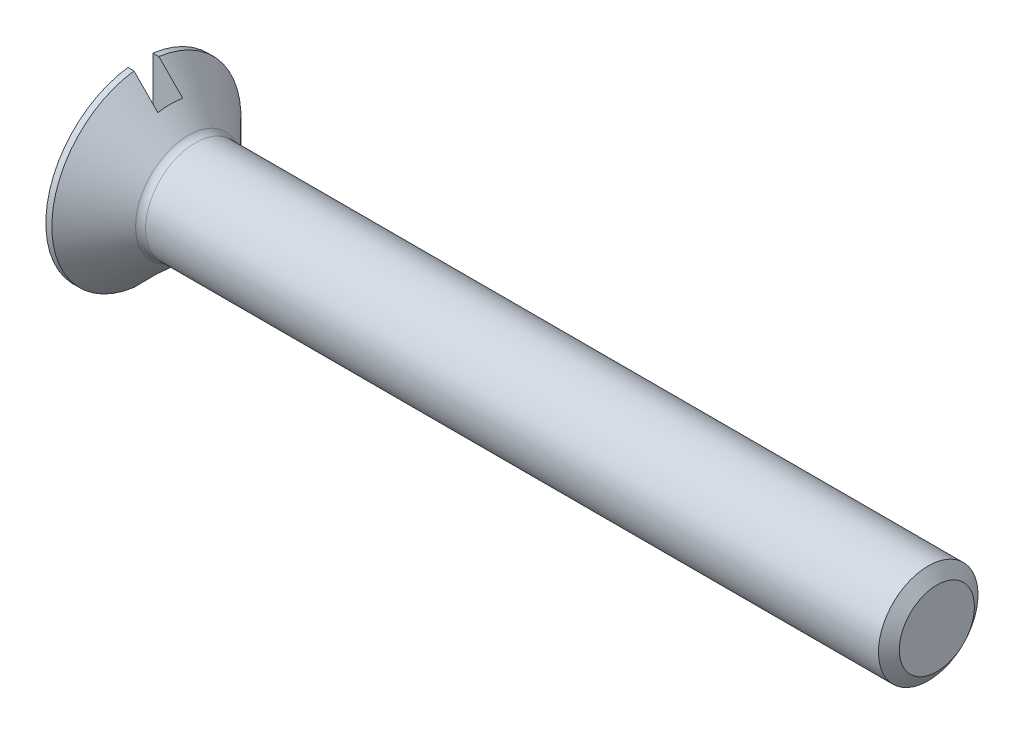
ISO-10303-21;
HEADER;
FILE_DESCRIPTION(('STEP AP214'),'2;1');
FILE_NAME('part.step','',(''),(''),'','','');
FILE_SCHEMA(('AUTOMOTIVE_DESIGN { 1 0 10303 214 1 1 1 1 }'));
ENDSEC;
DATA;
#1=APPLICATION_CONTEXT('core data for automotive mechanical design processes');
#2=APPLICATION_PROTOCOL_DEFINITION('international standard','automotive_design',2000,#1);
#3=PRODUCT_CONTEXT('',#1,'mechanical');
#4=PRODUCT('Part','Part','',(#3));
#5=PRODUCT_RELATED_PRODUCT_CATEGORY('part','',(#4));
#6=PRODUCT_DEFINITION_FORMATION('','',#4);
#7=PRODUCT_DEFINITION_CONTEXT('part definition',#1,'design');
#8=PRODUCT_DEFINITION('design','',#6,#7);
#9=PRODUCT_DEFINITION_SHAPE('','',#8);
#10=(LENGTH_UNIT() NAMED_UNIT(*) SI_UNIT(.MILLI.,.METRE.));
#11=(NAMED_UNIT(*) PLANE_ANGLE_UNIT() SI_UNIT($,.RADIAN.));
#12=(NAMED_UNIT(*) SI_UNIT($,.STERADIAN.) SOLID_ANGLE_UNIT());
#13=UNCERTAINTY_MEASURE_WITH_UNIT(LENGTH_MEASURE(1.E-05),#10,'distance_accuracy_value','');
#14=(GEOMETRIC_REPRESENTATION_CONTEXT(3) GLOBAL_UNCERTAINTY_ASSIGNED_CONTEXT((#13)) GLOBAL_UNIT_ASSIGNED_CONTEXT((#10,
#11,#12)) REPRESENTATION_CONTEXT('',''));
#15=CARTESIAN_POINT('',(0.,0.,0.));
#16=DIRECTION('',(0.,0.,1.));
#17=DIRECTION('',(1.,0.,0.));
#18=AXIS2_PLACEMENT_3D('',#15,#16,#17);
#19=CARTESIAN_POINT('',(0.600000000000003,16.,-0.25));
#20=DIRECTION('',(0.,0.,-1.));
#21=DIRECTION('',(-1.,0.,0.));
#22=AXIS2_PLACEMENT_3D('',#19,#20,#21);
#23=PLANE('',#22);
#24=CARTESIAN_POINT('',(0.12000000001922,1.88348082018038,-0.25));
#25=CARTESIAN_POINT('',(0.200138816678077,1.80267452085805,-0.25));
#26=CARTESIAN_POINT('',(0.280208220761208,1.72179961806493,-0.25));
#27=CARTESIAN_POINT('',(0.440208220791452,1.559912588321,-0.25));
#28=CARTESIAN_POINT('',(0.520138816709037,1.47890046134101,-0.25));
#29=CARTESIAN_POINT('',(0.60000000002137,1.39781973086105,-0.25));
#30=B_SPLINE_CURVE_WITH_KNOTS('',3,(#24,#25,#26,#27,#28,#29),.UNSPECIFIED.,.F.,.F.,(4,2,4),(0.,
0.341418708257502,0.68283748913234),.UNSPECIFIED.);
#31=CARTESIAN_POINT('',(0.12000000001922,1.88348082018374,-0.25));
#32=VERTEX_POINT('',#31);
#33=CARTESIAN_POINT('',(0.600000000020644,1.39781973086179,-0.25));
#34=VERTEX_POINT('',#33);
#35=EDGE_CURVE('E169',#32,#34,#30,.T.);
#36=ORIENTED_EDGE('',*,*,#35,.F.);
#37=DIRECTION('',(1.,0.,0.));
#38=VECTOR('',#37,1.);
#39=CARTESIAN_POINT('',(0.,1.88348082018374,-0.25));
#40=LINE('',#39,#38);
#41=CARTESIAN_POINT('',(0.,1.88348082018374,-0.25));
#42=VERTEX_POINT('',#41);
#43=EDGE_CURVE('E119',#42,#32,#40,.T.);
#44=ORIENTED_EDGE('',*,*,#43,.F.);
#45=DIRECTION('',(0.,1.,0.));
#46=VECTOR('',#45,1.);
#47=CARTESIAN_POINT('',(0.,1.88348082018374,-0.25));
#48=LINE('',#47,#46);
#49=CARTESIAN_POINT('',(0.,-1.88348082018374,-0.25));
#50=VERTEX_POINT('',#49);
#51=EDGE_CURVE('E114',#50,#42,#48,.T.);
#52=ORIENTED_EDGE('',*,*,#51,.F.);
#53=DIRECTION('',(1.,0.,0.));
#54=VECTOR('',#53,1.);
#55=CARTESIAN_POINT('',(0.,-1.88348082018374,-0.25));
#56=LINE('',#55,#54);
#57=CARTESIAN_POINT('',(0.120000000019221,-1.88348082018374,-0.25));
#58=VERTEX_POINT('',#57);
#59=EDGE_CURVE('E122',#50,#58,#56,.T.);
#60=ORIENTED_EDGE('',*,*,#59,.T.);
#61=CARTESIAN_POINT('',(0.600000000010433,-1.39781973087216,-0.25));
#62=CARTESIAN_POINT('',(0.520138816700536,-1.47890046134963,-0.25));
#63=CARTESIAN_POINT('',(0.440208220785391,-1.55991258832714,-0.25));
#64=CARTESIAN_POINT('',(0.280208220760037,-1.72179961806611,-0.25));
#65=CARTESIAN_POINT('',(0.200138816679355,-1.80267452085676,-0.25));
#66=CARTESIAN_POINT('',(0.120000000022954,-1.88348082017662,-0.25));
#67=B_SPLINE_CURVE_WITH_KNOTS('',3,(#61,#62,#63,#64,#65,#66),.UNSPECIFIED.,.F.,.F.,(4,2,4),(0.,
0.341418780864391,0.682837489111447),.UNSPECIFIED.);
#68=CARTESIAN_POINT('',(0.60000000000996,-1.39781973087264,-0.25));
#69=VERTEX_POINT('',#68);
#70=EDGE_CURVE('E140',#69,#58,#67,.T.);
#71=ORIENTED_EDGE('',*,*,#70,.F.);
#72=DIRECTION('',(0.,1.,0.));
#73=VECTOR('',#72,1.);
#74=CARTESIAN_POINT('',(0.600000000000003,16.,-0.25));
#75=LINE('',#74,#73);
#76=EDGE_CURVE('E137',#34,#69,#75,.F.);
#77=ORIENTED_EDGE('',*,*,#76,.F.);
#78=EDGE_LOOP('',(#36,#44,#52,#60,#71,#77));
#79=FACE_BOUND('',#78,.T.);
#80=ADVANCED_FACE('F39',(#79),#23,.F.);
#81=CARTESIAN_POINT('',(-1.,16.,0.25));
#82=DIRECTION('',(0.,0.,1.));
#83=DIRECTION('',(0.,-1.,0.));
#84=AXIS2_PLACEMENT_3D('',#81,#82,#83);
#85=PLANE('',#84);
#86=CARTESIAN_POINT('',(0.120000000015488,-1.88348082018415,0.25));
#87=CARTESIAN_POINT('',(0.200138816673137,-1.80267452086304,0.25));
#88=CARTESIAN_POINT('',(0.280208220755065,-1.72179961807114,0.25));
#89=CARTESIAN_POINT('',(0.440208220782907,-1.55991258832966,0.25));
#90=CARTESIAN_POINT('',(0.520138816699294,-1.47890046135089,0.25));
#91=CARTESIAN_POINT('',(0.600000000010432,-1.39781973087216,0.25));
#92=B_SPLINE_CURVE_WITH_KNOTS('',3,(#86,#87,#88,#89,#90,#91),.UNSPECIFIED.,.F.,.F.,(4,2,4),(0.,
0.341418708252357,0.68283748912205),.UNSPECIFIED.);
#93=CARTESIAN_POINT('',(0.120000000015488,-1.88348082018374,0.25));
#94=VERTEX_POINT('',#93);
#95=CARTESIAN_POINT('',(0.600000000015175,-1.39781973086734,0.25));
#96=VERTEX_POINT('',#95);
#97=EDGE_CURVE('E129',#94,#96,#92,.T.);
#98=ORIENTED_EDGE('',*,*,#97,.F.);
#99=DIRECTION('',(1.,0.,0.));
#100=VECTOR('',#99,1.);
#101=CARTESIAN_POINT('',(0.,-1.88348082018374,0.25));
#102=LINE('',#101,#100);
#103=CARTESIAN_POINT('',(0.,-1.88348082018374,0.25));
#104=VERTEX_POINT('',#103);
#105=EDGE_CURVE('E100',#104,#94,#102,.T.);
#106=ORIENTED_EDGE('',*,*,#105,.F.);
#107=DIRECTION('',(0.,-1.,0.));
#108=VECTOR('',#107,1.);
#109=CARTESIAN_POINT('',(0.,-1.88348082018374,0.25));
#110=LINE('',#109,#108);
#111=CARTESIAN_POINT('',(0.,1.88348082018374,0.25));
#112=VERTEX_POINT('',#111);
#113=EDGE_CURVE('E92',#112,#104,#110,.T.);
#114=ORIENTED_EDGE('',*,*,#113,.F.);
#115=DIRECTION('',(1.,0.,0.));
#116=VECTOR('',#115,1.);
#117=CARTESIAN_POINT('',(0.,1.88348082018374,0.25));
#118=LINE('',#117,#116);
#119=CARTESIAN_POINT('',(0.120000000015488,1.88348082018374,0.25));
#120=VERTEX_POINT('',#119);
#121=EDGE_CURVE('E97',#112,#120,#118,.T.);
#122=ORIENTED_EDGE('',*,*,#121,.T.);
#123=CARTESIAN_POINT('',(0.60000000002137,1.39781973086105,0.25));
#124=CARTESIAN_POINT('',(0.520138816709037,1.47890046134101,0.25));
#125=CARTESIAN_POINT('',(0.440208220791452,1.559912588321,0.25));
#126=CARTESIAN_POINT('',(0.280208220761208,1.72179961806493,0.25));
#127=CARTESIAN_POINT('',(0.200138816678077,1.80267452085805,0.25));
#128=CARTESIAN_POINT('',(0.12000000001922,1.88348082018038,0.25));
#129=B_SPLINE_CURVE_WITH_KNOTS('',3,(#123,#124,#125,#126,#127,#128),.UNSPECIFIED.,.F.,.F.,(4,2,
4),(0.,0.341418780874838,0.68283748913234),.UNSPECIFIED.);
#130=CARTESIAN_POINT('',(0.60000000000996,1.39781973087264,0.25));
#131=VERTEX_POINT('',#130);
#132=EDGE_CURVE('E128',#131,#120,#129,.T.);
#133=ORIENTED_EDGE('',*,*,#132,.F.);
#134=DIRECTION('',(0.,-1.,0.));
#135=VECTOR('',#134,1.);
#136=CARTESIAN_POINT('',(0.600000000000003,16.,0.25));
#137=LINE('',#136,#135);
#138=EDGE_CURVE('E125',#96,#131,#137,.F.);
#139=ORIENTED_EDGE('',*,*,#138,.F.);
#140=EDGE_LOOP('',(#98,#106,#114,#122,#133,#139));
#141=FACE_BOUND('',#140,.T.);
#142=ADVANCED_FACE('F94',(#141),#85,.F.);
#143=CARTESIAN_POINT('',(0.600000000000003,16.,0.25));
#144=DIRECTION('',(1.,0.,0.));
#145=DIRECTION('',(0.,1.,0.));
#146=AXIS2_PLACEMENT_3D('',#143,#144,#145);
#147=PLANE('',#146);
#148=ORIENTED_EDGE('',*,*,#76,.T.);
#149=CARTESIAN_POINT('',(0.600000000019918,0.,0.));
#150=DIRECTION('',(-1.,0.,0.));
#151=DIRECTION('',(0.,-1.,0.));
#152=AXIS2_PLACEMENT_3D('',#149,#150,#151);
#153=CIRCLE('',#152,1.41999999999598);
#154=EDGE_CURVE('E61',#96,#69,#153,.F.);
#155=ORIENTED_EDGE('',*,*,#154,.F.);
#156=ORIENTED_EDGE('',*,*,#138,.T.);
#157=CARTESIAN_POINT('',(0.600000000019918,0.,0.));
#158=DIRECTION('',(-1.,0.,0.));
#159=DIRECTION('',(0.,-1.,0.));
#160=AXIS2_PLACEMENT_3D('',#157,#158,#159);
#161=CIRCLE('',#160,1.41999999999598);
#162=EDGE_CURVE('E54',#34,#131,#161,.F.);
#163=ORIENTED_EDGE('',*,*,#162,.F.);
#164=EDGE_LOOP('',(#148,#155,#156,#163));
#165=FACE_BOUND('',#164,.T.);
#166=ADVANCED_FACE('F163',(#165),#147,.F.);
#167=CARTESIAN_POINT('',(0.12000000003809,0.,0.));
#168=DIRECTION('',(-1.,0.,0.));
#169=DIRECTION('',(0.,-1.,0.));
#170=AXIS2_PLACEMENT_3D('',#167,#168,#169);
#171=CONICAL_SURFACE('',#170,1.89999999997781,0.785398163397448);
#172=CARTESIAN_POINT('',(0.961421356253208,0.,0.));
#173=DIRECTION('',(1.,0.,0.));
#174=DIRECTION('',(0.,1.,0.));
#175=AXIS2_PLACEMENT_3D('',#172,#173,#174);
#176=CIRCLE('',#175,1.05857864376269);
#177=CARTESIAN_POINT('',(0.961421356253208,1.05857864376269,0.));
#178=VERTEX_POINT('',#177);
#179=EDGE_CURVE('E12',#178,#178,#176,.F.);
#180=ORIENTED_EDGE('',*,*,#179,.T.);
#181=EDGE_LOOP('',(#180));
#182=FACE_BOUND('',#181,.T.);
#183=ORIENTED_EDGE('',*,*,#97,.T.);
#184=ORIENTED_EDGE('',*,*,#154,.T.);
#185=ORIENTED_EDGE('',*,*,#70,.T.);
#186=CARTESIAN_POINT('',(0.120000000038089,0.,0.));
#187=DIRECTION('',(-1.,0.,0.));
#188=DIRECTION('',(0.,-1.,0.));
#189=AXIS2_PLACEMENT_3D('',#186,#187,#188);
#190=CIRCLE('',#189,1.89999999997781);
#191=EDGE_CURVE('E133',#58,#32,#190,.F.);
#192=ORIENTED_EDGE('',*,*,#191,.T.);
#193=ORIENTED_EDGE('',*,*,#35,.T.);
#194=ORIENTED_EDGE('',*,*,#162,.T.);
#195=ORIENTED_EDGE('',*,*,#132,.T.);
#196=CARTESIAN_POINT('',(0.120000000038089,0.,0.));
#197=DIRECTION('',(-1.,0.,0.));
#198=DIRECTION('',(0.,-1.,0.));
#199=AXIS2_PLACEMENT_3D('',#196,#197,#198);
#200=CIRCLE('',#199,1.89999999997781);
#201=EDGE_CURVE('E110',#120,#94,#200,.F.);
#202=ORIENTED_EDGE('',*,*,#201,.T.);
#203=EDGE_LOOP('',(#183,#184,#185,#192,#193,#194,#195,#202));
#204=FACE_BOUND('',#203,.T.);
#205=ADVANCED_FACE('F158',(#182,#204),#171,.T.);
#206=CARTESIAN_POINT('',(0.,0.,0.));
#207=DIRECTION('',(1.,0.,0.));
#208=DIRECTION('',(0.,1.,0.));
#209=AXIS2_PLACEMENT_3D('',#206,#207,#208);
#210=CYLINDRICAL_SURFACE('',#209,1.9);
#211=ORIENTED_EDGE('',*,*,#191,.F.);
#212=ORIENTED_EDGE('',*,*,#59,.F.);
#213=CARTESIAN_POINT('',(0.,0.,0.));
#214=DIRECTION('',(-1.,0.,0.));
#215=DIRECTION('',(0.,1.,0.));
#216=AXIS2_PLACEMENT_3D('',#213,#214,#215);
#217=CIRCLE('',#216,1.9);
#218=EDGE_CURVE('E111',#42,#50,#217,.T.);
#219=ORIENTED_EDGE('',*,*,#218,.F.);
#220=ORIENTED_EDGE('',*,*,#43,.T.);
#221=EDGE_LOOP('',(#211,#212,#219,#220));
#222=FACE_BOUND('',#221,.T.);
#223=ADVANCED_FACE('F162',(#222),#210,.T.);
#224=CARTESIAN_POINT('',(0.,0.,0.));
#225=DIRECTION('',(1.,0.,0.));
#226=DIRECTION('',(0.,1.,0.));
#227=AXIS2_PLACEMENT_3D('',#224,#225,#226);
#228=PLANE('',#227);
#229=ORIENTED_EDGE('',*,*,#218,.T.);
#230=ORIENTED_EDGE('',*,*,#51,.T.);
#231=EDGE_LOOP('',(#229,#230));
#232=FACE_BOUND('',#231,.T.);
#233=ADVANCED_FACE('F223',(#232),#228,.F.);
#234=CARTESIAN_POINT('',(0.,0.,0.));
#235=DIRECTION('',(1.,0.,0.));
#236=DIRECTION('',(0.,1.,0.));
#237=AXIS2_PLACEMENT_3D('',#234,#235,#236);
#238=CYLINDRICAL_SURFACE('',#237,1.9);
#239=ORIENTED_EDGE('',*,*,#201,.F.);
#240=ORIENTED_EDGE('',*,*,#121,.F.);
#241=CARTESIAN_POINT('',(0.,0.,0.));
#242=DIRECTION('',(-1.,0.,0.));
#243=DIRECTION('',(0.,1.,0.));
#244=AXIS2_PLACEMENT_3D('',#241,#242,#243);
#245=CIRCLE('',#244,1.9);
#246=EDGE_CURVE('E103',#104,#112,#245,.T.);
#247=ORIENTED_EDGE('',*,*,#246,.F.);
#248=ORIENTED_EDGE('',*,*,#105,.T.);
#249=EDGE_LOOP('',(#239,#240,#247,#248));
#250=FACE_BOUND('',#249,.T.);
#251=ADVANCED_FACE('F108',(#250),#238,.T.);
#252=CARTESIAN_POINT('',(0.,0.,0.));
#253=DIRECTION('',(1.,0.,0.));
#254=DIRECTION('',(0.,1.,0.));
#255=AXIS2_PLACEMENT_3D('',#252,#253,#254);
#256=PLANE('',#255);
#257=ORIENTED_EDGE('',*,*,#246,.T.);
#258=ORIENTED_EDGE('',*,*,#113,.T.);
#259=EDGE_LOOP('',(#257,#258));
#260=FACE_BOUND('',#259,.T.);
#261=ADVANCED_FACE('F105',(#260),#256,.F.);
#262=CARTESIAN_POINT('',(16.,0.,0.));
#263=DIRECTION('',(-1.,0.,0.));
#264=DIRECTION('',(0.,0.,1.));
#265=AXIS2_PLACEMENT_3D('',#262,#263,#264);
#266=CYLINDRICAL_SURFACE('',#265,1.);
#267=CARTESIAN_POINT('',(1.10284271249052,0.,0.));
#268=DIRECTION('',(1.,0.,0.));
#269=DIRECTION('',(0.,1.,0.));
#270=AXIS2_PLACEMENT_3D('',#267,#268,#269);
#271=CIRCLE('',#270,1.);
#272=CARTESIAN_POINT('',(1.10284271249052,1.,0.));
#273=VERTEX_POINT('',#272);
#274=EDGE_CURVE('E47',#273,#273,#271,.T.);
#275=ORIENTED_EDGE('',*,*,#274,.T.);
#276=EDGE_LOOP('',(#275));
#277=FACE_BOUND('',#276,.T.);
#278=CARTESIAN_POINT('',(15.8264052853139,0.,0.));
#279=DIRECTION('',(1.,0.,0.));
#280=DIRECTION('',(0.,0.,-1.));
#281=AXIS2_PLACEMENT_3D('',#278,#279,#280);
#282=CIRCLE('',#281,1.);
#283=CARTESIAN_POINT('',(15.8264052853139,0.,-1.));
#284=VERTEX_POINT('',#283);
#285=EDGE_CURVE('E205',#284,#284,#282,.F.);
#286=ORIENTED_EDGE('',*,*,#285,.T.);
#287=EDGE_LOOP('',(#286));
#288=FACE_BOUND('',#287,.T.);
#289=ADVANCED_FACE('F199',(#277,#288),#266,.T.);
#290=CARTESIAN_POINT('',(16.,0.,0.));
#291=DIRECTION('',(1.,0.,0.));
#292=DIRECTION('',(0.,0.,-1.));
#293=AXIS2_PLACEMENT_3D('',#290,#291,#292);
#294=PLANE('',#293);
#295=CARTESIAN_POINT('',(16.,0.,0.));
#296=DIRECTION('',(1.,0.,0.));
#297=DIRECTION('',(0.,0.,-1.));
#298=AXIS2_PLACEMENT_3D('',#295,#296,#297);
#299=CIRCLE('',#298,0.754500000138681);
#300=CARTESIAN_POINT('',(16.,0.,-0.754500000138681));
#301=VERTEX_POINT('',#300);
#302=EDGE_CURVE('E132',#301,#301,#299,.T.);
#303=ORIENTED_EDGE('',*,*,#302,.T.);
#304=EDGE_LOOP('',(#303));
#305=FACE_BOUND('',#304,.T.);
#306=ADVANCED_FACE('F192',(#305),#294,.T.);
#307=CARTESIAN_POINT('',(16.,0.,0.));
#308=DIRECTION('',(-1.,0.,0.));
#309=DIRECTION('',(0.,0.,1.));
#310=AXIS2_PLACEMENT_3D('',#307,#308,#309);
#311=CONICAL_SURFACE('',#310,0.754500000138681,0.955316618116642);
#312=ORIENTED_EDGE('',*,*,#285,.F.);
#313=EDGE_LOOP('',(#312));
#314=FACE_BOUND('',#313,.T.);
#315=ORIENTED_EDGE('',*,*,#302,.F.);
#316=EDGE_LOOP('',(#315));
#317=FACE_BOUND('',#316,.T.);
#318=ADVANCED_FACE('F190',(#314,#317),#311,.T.);
#319=CARTESIAN_POINT('',(1.10284271249052,0.,0.));
#320=DIRECTION('',(1.,0.,0.));
#321=DIRECTION('',(0.,1.,0.));
#322=AXIS2_PLACEMENT_3D('',#319,#320,#321);
#323=TOROIDAL_SURFACE('',#322,1.2,0.199999999999998);
#324=ORIENTED_EDGE('',*,*,#179,.F.);
#325=EDGE_LOOP('',(#324));
#326=FACE_BOUND('',#325,.T.);
#327=ORIENTED_EDGE('',*,*,#274,.F.);
#328=EDGE_LOOP('',(#327));
#329=FACE_BOUND('',#328,.T.);
#330=ADVANCED_FACE('F41',(#326,#329),#323,.F.);
#331=CLOSED_SHELL('',(#80,#142,#166,#205,#223,#233,#251,#261,#289,#306,#318,#330));
#332=MANIFOLD_SOLID_BREP('B2',#331);
#333=ADVANCED_BREP_SHAPE_REPRESENTATION('',(#18,#332),#14);
#334=SHAPE_DEFINITION_REPRESENTATION(#9,#333);
ENDSEC;
END-ISO-10303-21;
